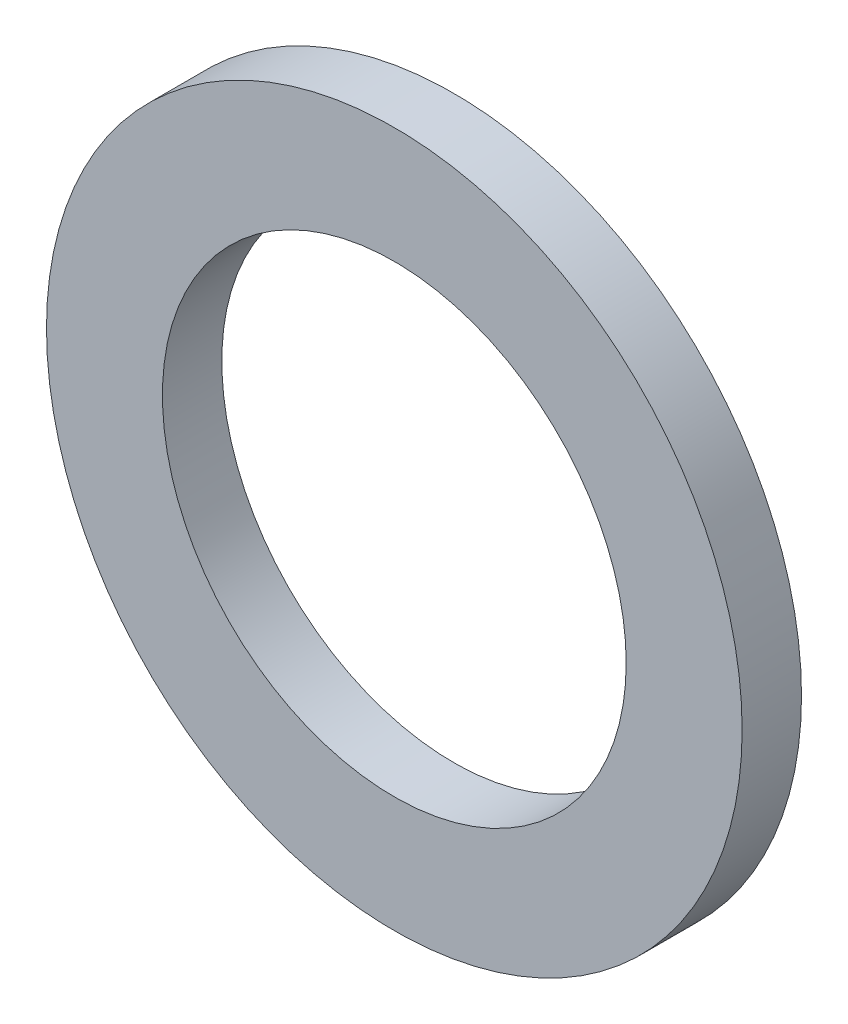
ISO-10303-21;
HEADER;
FILE_DESCRIPTION(('STEP AP214'),'2;1');
FILE_NAME('part.step','',(''),(''),'','','');
FILE_SCHEMA(('AUTOMOTIVE_DESIGN { 1 0 10303 214 1 1 1 1 }'));
ENDSEC;
DATA;
#1=APPLICATION_CONTEXT('core data for automotive mechanical design processes');
#2=APPLICATION_PROTOCOL_DEFINITION('international standard','automotive_design',2000,#1);
#3=PRODUCT_CONTEXT('',#1,'mechanical');
#4=PRODUCT('Part','Part','',(#3));
#5=PRODUCT_RELATED_PRODUCT_CATEGORY('part','',(#4));
#6=PRODUCT_DEFINITION_FORMATION('','',#4);
#7=PRODUCT_DEFINITION_CONTEXT('part definition',#1,'design');
#8=PRODUCT_DEFINITION('design','',#6,#7);
#9=PRODUCT_DEFINITION_SHAPE('','',#8);
#10=(LENGTH_UNIT() NAMED_UNIT(*) SI_UNIT(.MILLI.,.METRE.));
#11=(NAMED_UNIT(*) PLANE_ANGLE_UNIT() SI_UNIT($,.RADIAN.));
#12=(NAMED_UNIT(*) SI_UNIT($,.STERADIAN.) SOLID_ANGLE_UNIT());
#13=UNCERTAINTY_MEASURE_WITH_UNIT(LENGTH_MEASURE(1.E-05),#10,'distance_accuracy_value','');
#14=(GEOMETRIC_REPRESENTATION_CONTEXT(3) GLOBAL_UNCERTAINTY_ASSIGNED_CONTEXT((#13)) GLOBAL_UNIT_ASSIGNED_CONTEXT((#10,
#11,#12)) REPRESENTATION_CONTEXT('',''));
#15=CARTESIAN_POINT('',(0.,0.,0.));
#16=DIRECTION('',(0.,0.,1.));
#17=DIRECTION('',(1.,0.,0.));
#18=AXIS2_PLACEMENT_3D('',#15,#16,#17);
#19=CARTESIAN_POINT('',(0.,0.,0.));
#20=DIRECTION('',(0.,0.,0.999999999999995));
#21=DIRECTION('',(0.999999999999997,0.,0.));
#22=AXIS2_PLACEMENT_3D('',#19,#20,#21);
#23=CYLINDRICAL_SURFACE('',#22,1.5875);
#24=CARTESIAN_POINT('',(0.,0.,0.406400000000001));
#25=DIRECTION('',(0.,0.,0.999999999999995));
#26=DIRECTION('',(0.999999999999997,0.,0.));
#27=AXIS2_PLACEMENT_3D('',#24,#25,#26);
#28=CIRCLE('',#27,1.5875);
#29=CARTESIAN_POINT('',(1.5875,0.,0.406399999999999));
#30=VERTEX_POINT('',#29);
#31=EDGE_CURVE('E12',#30,#30,#28,.T.);
#32=ORIENTED_EDGE('',*,*,#31,.T.);
#33=EDGE_LOOP('',(#32));
#34=FACE_BOUND('',#33,.T.);
#35=CARTESIAN_POINT('',(0.,0.,0.));
#36=DIRECTION('',(0.,0.,0.999999999999995));
#37=DIRECTION('',(0.999999999999997,0.,0.));
#38=AXIS2_PLACEMENT_3D('',#35,#36,#37);
#39=CIRCLE('',#38,1.5875);
#40=CARTESIAN_POINT('',(1.5875,0.,0.));
#41=VERTEX_POINT('',#40);
#42=EDGE_CURVE('E54',#41,#41,#39,.T.);
#43=ORIENTED_EDGE('',*,*,#42,.F.);
#44=EDGE_LOOP('',(#43));
#45=FACE_BOUND('',#44,.T.);
#46=ADVANCED_FACE('F40',(#34,#45),#23,.F.);
#47=CARTESIAN_POINT('',(1.58750000000002,0.,0.406400000000001));
#48=DIRECTION('',(0.,0.,0.999999999999995));
#49=DIRECTION('',(0.999999999999997,0.,0.));
#50=AXIS2_PLACEMENT_3D('',#47,#48,#49);
#51=PLANE('',#50);
#52=CARTESIAN_POINT('',(0.,0.,0.406400000000001));
#53=DIRECTION('',(0.,0.,0.999999999999995));
#54=DIRECTION('',(0.999999999999997,0.,0.));
#55=AXIS2_PLACEMENT_3D('',#52,#53,#54);
#56=CIRCLE('',#55,2.38125);
#57=CARTESIAN_POINT('',(2.38124999999999,0.,0.406399999999997));
#58=VERTEX_POINT('',#57);
#59=EDGE_CURVE('E46',#58,#58,#56,.T.);
#60=ORIENTED_EDGE('',*,*,#59,.T.);
#61=EDGE_LOOP('',(#60));
#62=FACE_BOUND('',#61,.T.);
#63=ORIENTED_EDGE('',*,*,#31,.F.);
#64=EDGE_LOOP('',(#63));
#65=FACE_BOUND('',#64,.T.);
#66=ADVANCED_FACE('F64',(#62,#65),#51,.T.);
#67=CARTESIAN_POINT('',(0.,0.,0.));
#68=DIRECTION('',(0.,0.,0.999999999999995));
#69=DIRECTION('',(0.999999999999997,0.,0.));
#70=AXIS2_PLACEMENT_3D('',#67,#68,#69);
#71=CYLINDRICAL_SURFACE('',#70,2.38125);
#72=CARTESIAN_POINT('',(0.,0.,0.));
#73=DIRECTION('',(0.,0.,0.999999999999995));
#74=DIRECTION('',(0.999999999999997,0.,0.));
#75=AXIS2_PLACEMENT_3D('',#72,#73,#74);
#76=CIRCLE('',#75,2.38125);
#77=CARTESIAN_POINT('',(2.38124999999999,0.,0.));
#78=VERTEX_POINT('',#77);
#79=EDGE_CURVE('E50',#78,#78,#76,.T.);
#80=ORIENTED_EDGE('',*,*,#79,.T.);
#81=EDGE_LOOP('',(#80));
#82=FACE_BOUND('',#81,.T.);
#83=ORIENTED_EDGE('',*,*,#59,.F.);
#84=EDGE_LOOP('',(#83));
#85=FACE_BOUND('',#84,.T.);
#86=ADVANCED_FACE('F68',(#82,#85),#71,.T.);
#87=CARTESIAN_POINT('',(2.38124999999999,0.,0.));
#88=DIRECTION('',(0.,0.,-0.999999999999995));
#89=DIRECTION('',(-0.999999999999997,0.,0.));
#90=AXIS2_PLACEMENT_3D('',#87,#88,#89);
#91=PLANE('',#90);
#92=ORIENTED_EDGE('',*,*,#42,.T.);
#93=EDGE_LOOP('',(#92));
#94=FACE_BOUND('',#93,.T.);
#95=ORIENTED_EDGE('',*,*,#79,.F.);
#96=EDGE_LOOP('',(#95));
#97=FACE_BOUND('',#96,.T.);
#98=ADVANCED_FACE('F60',(#94,#97),#91,.T.);
#99=CLOSED_SHELL('',(#46,#66,#86,#98));
#100=MANIFOLD_SOLID_BREP('B2',#99);
#101=ADVANCED_BREP_SHAPE_REPRESENTATION('',(#18,#100),#14);
#102=SHAPE_DEFINITION_REPRESENTATION(#9,#101);
ENDSEC;
END-ISO-10303-21;
